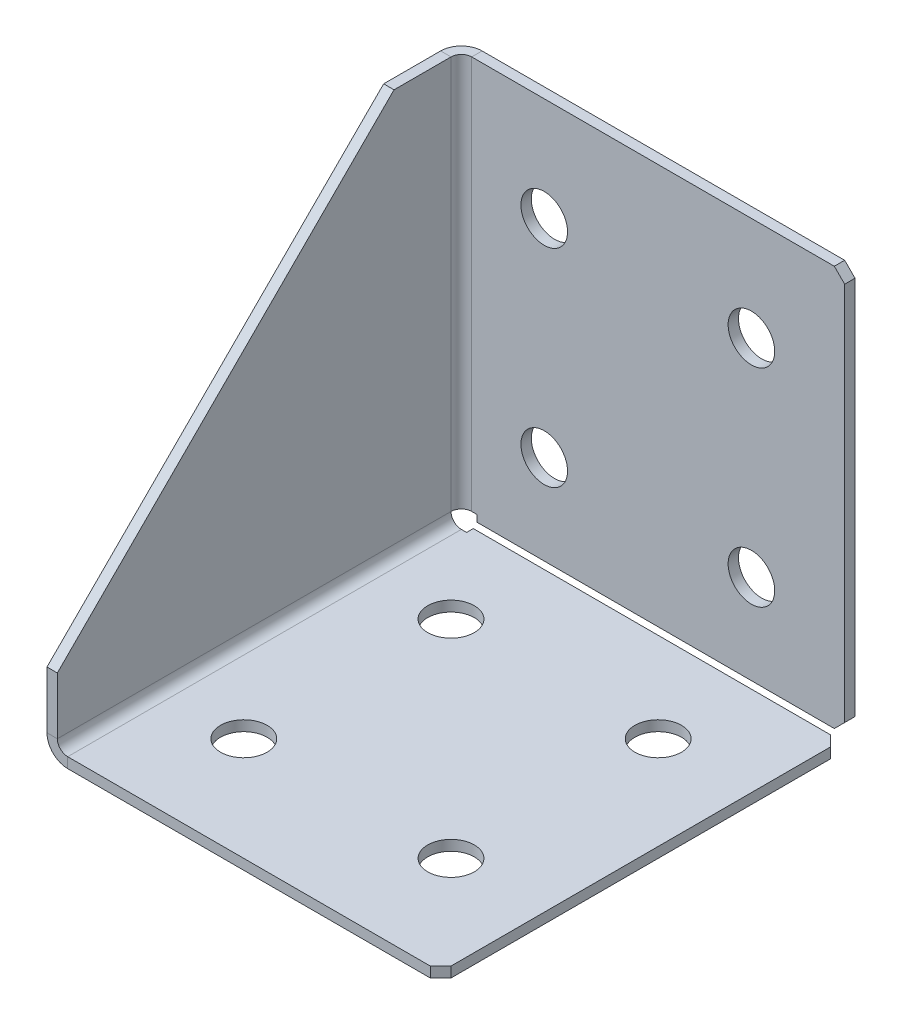
ISO-10303-21;
HEADER;
FILE_DESCRIPTION(('STEP AP214'),'2;1');
FILE_NAME('part.step','',(''),(''),'','','');
FILE_SCHEMA(('AUTOMOTIVE_DESIGN { 1 0 10303 214 1 1 1 1 }'));
ENDSEC;
DATA;
#1=APPLICATION_CONTEXT('core data for automotive mechanical design processes');
#2=APPLICATION_PROTOCOL_DEFINITION('international standard','automotive_design',2000,#1);
#3=PRODUCT_CONTEXT('',#1,'mechanical');
#4=PRODUCT('Part','Part','',(#3));
#5=PRODUCT_RELATED_PRODUCT_CATEGORY('part','',(#4));
#6=PRODUCT_DEFINITION_FORMATION('','',#4);
#7=PRODUCT_DEFINITION_CONTEXT('part definition',#1,'design');
#8=PRODUCT_DEFINITION('design','',#6,#7);
#9=PRODUCT_DEFINITION_SHAPE('','',#8);
#10=(LENGTH_UNIT() NAMED_UNIT(*) SI_UNIT(.MILLI.,.METRE.));
#11=(NAMED_UNIT(*) PLANE_ANGLE_UNIT() SI_UNIT($,.RADIAN.));
#12=(NAMED_UNIT(*) SI_UNIT($,.STERADIAN.) SOLID_ANGLE_UNIT());
#13=UNCERTAINTY_MEASURE_WITH_UNIT(LENGTH_MEASURE(1.E-05),#10,'distance_accuracy_value','');
#14=(GEOMETRIC_REPRESENTATION_CONTEXT(3) GLOBAL_UNCERTAINTY_ASSIGNED_CONTEXT((#13)) GLOBAL_UNIT_ASSIGNED_CONTEXT((#10,
#11,#12)) REPRESENTATION_CONTEXT('',''));
#15=CARTESIAN_POINT('',(0.,0.,0.));
#16=DIRECTION('',(0.,0.,1.));
#17=DIRECTION('',(1.,0.,0.));
#18=AXIS2_PLACEMENT_3D('',#15,#16,#17);
#19=CARTESIAN_POINT('',(-38.,2.,80.));
#20=DIRECTION('',(0.,-1.,0.));
#21=DIRECTION('',(0.,0.,-1.));
#22=AXIS2_PLACEMENT_3D('',#19,#20,#21);
#23=PLANE('',#22);
#24=CARTESIAN_POINT('',(-20.,2.,20.));
#25=DIRECTION('',(0.,1.,0.));
#26=DIRECTION('',(0.,0.,1.));
#27=AXIS2_PLACEMENT_3D('',#24,#25,#26);
#28=CIRCLE('',#27,4.5);
#29=CARTESIAN_POINT('',(-20.,2.,24.5));
#30=VERTEX_POINT('',#29);
#31=EDGE_CURVE('E689',#30,#30,#28,.T.);
#32=ORIENTED_EDGE('',*,*,#31,.F.);
#33=EDGE_LOOP('',(#32));
#34=FACE_BOUND('',#33,.T.);
#35=DIRECTION('',(1.,0.,0.));
#36=VECTOR('',#35,1.);
#37=CARTESIAN_POINT('',(-38.,2.,80.));
#38=LINE('',#37,#36);
#39=CARTESIAN_POINT('',(-34.,2.,80.));
#40=VERTEX_POINT('',#39);
#41=CARTESIAN_POINT('',(36.,2.,80.));
#42=VERTEX_POINT('',#41);
#43=EDGE_CURVE('E348',#40,#42,#38,.T.);
#44=ORIENTED_EDGE('',*,*,#43,.T.);
#45=DIRECTION('',(-0.70710678118655,0.,0.707106781186545));
#46=VECTOR('',#45,1.);
#47=CARTESIAN_POINT('',(38.,2.,78.));
#48=LINE('',#47,#46);
#49=CARTESIAN_POINT('',(38.,2.,78.));
#50=VERTEX_POINT('',#49);
#51=EDGE_CURVE('E429',#42,#50,#48,.F.);
#52=ORIENTED_EDGE('',*,*,#51,.T.);
#53=DIRECTION('',(0.,0.,-1.));
#54=VECTOR('',#53,1.);
#55=CARTESIAN_POINT('',(38.,2.,80.));
#56=LINE('',#55,#54);
#57=CARTESIAN_POINT('',(38.,2.,4.70710678118655));
#58=VERTEX_POINT('',#57);
#59=EDGE_CURVE('E356',#50,#58,#56,.T.);
#60=ORIENTED_EDGE('',*,*,#59,.T.);
#61=DIRECTION('',(-0.707106781186548,0.,-0.707106781186548));
#62=VECTOR('',#61,1.);
#63=CARTESIAN_POINT('',(36.,2.,2.70710678118655));
#64=LINE('',#63,#62);
#65=CARTESIAN_POINT('',(36.,2.,2.70710678118655));
#66=VERTEX_POINT('',#65);
#67=EDGE_CURVE('E426',#58,#66,#64,.T.);
#68=ORIENTED_EDGE('',*,*,#67,.T.);
#69=DIRECTION('',(1.,0.,0.));
#70=VECTOR('',#69,1.);
#71=CARTESIAN_POINT('',(-38.,2.,2.70710678118655));
#72=LINE('',#71,#70);
#73=CARTESIAN_POINT('',(-32.989599,2.,2.70710678118655));
#74=VERTEX_POINT('',#73);
#75=EDGE_CURVE('E326',#74,#66,#72,.T.);
#76=ORIENTED_EDGE('',*,*,#75,.F.);
#77=DIRECTION('',(0.,0.,-1.));
#78=VECTOR('',#77,1.);
#79=CARTESIAN_POINT('',(-32.989599,2.,80.));
#80=LINE('',#79,#78);
#81=CARTESIAN_POINT('',(-32.989599,2.,3.99999999999998));
#82=VERTEX_POINT('',#81);
#83=EDGE_CURVE('E325',#82,#74,#80,.T.);
#84=ORIENTED_EDGE('',*,*,#83,.F.);
#85=DIRECTION('',(1.,0.,0.));
#86=VECTOR('',#85,1.);
#87=CARTESIAN_POINT('',(-38.,2.,3.99999999999998));
#88=LINE('',#87,#86);
#89=CARTESIAN_POINT('',(-34.,2.,3.99999999999998));
#90=VERTEX_POINT('',#89);
#91=EDGE_CURVE('E321',#82,#90,#88,.F.);
#92=ORIENTED_EDGE('',*,*,#91,.T.);
#93=DIRECTION('',(0.,0.,-1.));
#94=VECTOR('',#93,1.);
#95=CARTESIAN_POINT('',(-34.,2.,80.));
#96=LINE('',#95,#94);
#97=EDGE_CURVE('E307',#40,#90,#96,.T.);
#98=ORIENTED_EDGE('',*,*,#97,.F.);
#99=EDGE_LOOP('',(#44,#52,#60,#68,#76,#84,#92,#98));
#100=FACE_BOUND('',#99,.T.);
#101=CARTESIAN_POINT('',(20.,2.,20.));
#102=DIRECTION('',(0.,1.,0.));
#103=DIRECTION('',(0.,0.,1.));
#104=AXIS2_PLACEMENT_3D('',#101,#102,#103);
#105=CIRCLE('',#104,4.5);
#106=CARTESIAN_POINT('',(20.,2.,24.5));
#107=VERTEX_POINT('',#106);
#108=EDGE_CURVE('E665',#107,#107,#105,.T.);
#109=ORIENTED_EDGE('',*,*,#108,.F.);
#110=EDGE_LOOP('',(#109));
#111=FACE_BOUND('',#110,.T.);
#112=CARTESIAN_POINT('',(-20.,2.,60.));
#113=DIRECTION('',(0.,1.,0.));
#114=DIRECTION('',(0.,0.,1.));
#115=AXIS2_PLACEMENT_3D('',#112,#113,#114);
#116=CIRCLE('',#115,4.5);
#117=CARTESIAN_POINT('',(-20.,2.,64.5));
#118=VERTEX_POINT('',#117);
#119=EDGE_CURVE('E673',#118,#118,#116,.T.);
#120=ORIENTED_EDGE('',*,*,#119,.F.);
#121=EDGE_LOOP('',(#120));
#122=FACE_BOUND('',#121,.T.);
#123=CARTESIAN_POINT('',(20.,2.,60.));
#124=DIRECTION('',(0.,1.,0.));
#125=DIRECTION('',(0.,0.,1.));
#126=AXIS2_PLACEMENT_3D('',#123,#124,#125);
#127=CIRCLE('',#126,4.5);
#128=CARTESIAN_POINT('',(20.,2.,64.5));
#129=VERTEX_POINT('',#128);
#130=EDGE_CURVE('E681',#129,#129,#127,.T.);
#131=ORIENTED_EDGE('',*,*,#130,.F.);
#132=EDGE_LOOP('',(#131));
#133=FACE_BOUND('',#132,.T.);
#134=ADVANCED_FACE('F50',(#34,#100,#111,#122,#133),#23,.F.);
#135=CARTESIAN_POINT('',(-38.,0.,2.));
#136=DIRECTION('',(0.,0.,-1.));
#137=DIRECTION('',(-1.,0.,0.));
#138=AXIS2_PLACEMENT_3D('',#135,#136,#137);
#139=PLANE('',#138);
#140=DIRECTION('',(-1.,0.,0.));
#141=VECTOR('',#140,1.);
#142=CARTESIAN_POINT('',(-38.,2.70710678118655,2.));
#143=LINE('',#142,#141);
#144=CARTESIAN_POINT('',(36.,2.70710678118655,2.));
#145=VERTEX_POINT('',#144);
#146=CARTESIAN_POINT('',(-32.989599,2.70710678118655,2.));
#147=VERTEX_POINT('',#146);
#148=EDGE_CURVE('E322',#145,#147,#143,.T.);
#149=ORIENTED_EDGE('',*,*,#148,.F.);
#150=DIRECTION('',(0.707106781186548,0.707106781186548,0.));
#151=VECTOR('',#150,1.);
#152=CARTESIAN_POINT('',(38.,4.70710678118656,2.));
#153=LINE('',#152,#151);
#154=CARTESIAN_POINT('',(38.,4.70710678118656,2.));
#155=VERTEX_POINT('',#154);
#156=EDGE_CURVE('E60',#145,#155,#153,.T.);
#157=ORIENTED_EDGE('',*,*,#156,.T.);
#158=DIRECTION('',(0.,1.,0.));
#159=VECTOR('',#158,1.);
#160=CARTESIAN_POINT('',(38.,0.,2.));
#161=LINE('',#160,#159);
#162=CARTESIAN_POINT('',(38.,78.,2.));
#163=VERTEX_POINT('',#162);
#164=EDGE_CURVE('E327',#155,#163,#161,.T.);
#165=ORIENTED_EDGE('',*,*,#164,.T.);
#166=DIRECTION('',(-0.707106781186548,0.707106781186548,0.));
#167=VECTOR('',#166,1.);
#168=CARTESIAN_POINT('',(36.,80.,2.));
#169=LINE('',#168,#167);
#170=CARTESIAN_POINT('',(36.,80.,2.));
#171=VERTEX_POINT('',#170);
#172=EDGE_CURVE('E67',#163,#171,#169,.T.);
#173=ORIENTED_EDGE('',*,*,#172,.T.);
#174=DIRECTION('',(-1.,0.,0.));
#175=VECTOR('',#174,1.);
#176=CARTESIAN_POINT('',(-38.,80.,2.));
#177=LINE('',#176,#175);
#178=CARTESIAN_POINT('',(-34.,80.,2.));
#179=VERTEX_POINT('',#178);
#180=EDGE_CURVE('E330',#179,#171,#177,.F.);
#181=ORIENTED_EDGE('',*,*,#180,.F.);
#182=DIRECTION('',(0.,1.,0.));
#183=VECTOR('',#182,1.);
#184=CARTESIAN_POINT('',(-34.,0.,2.));
#185=LINE('',#184,#183);
#186=CARTESIAN_POINT('',(-34.,3.99999999999997,2.));
#187=VERTEX_POINT('',#186);
#188=EDGE_CURVE('E298',#187,#179,#185,.T.);
#189=ORIENTED_EDGE('',*,*,#188,.F.);
#190=DIRECTION('',(-1.,0.,0.));
#191=VECTOR('',#190,1.);
#192=CARTESIAN_POINT('',(-38.,3.99999999999997,2.));
#193=LINE('',#192,#191);
#194=CARTESIAN_POINT('',(-32.989599,3.99999999999997,2.));
#195=VERTEX_POINT('',#194);
#196=EDGE_CURVE('E303',#187,#195,#193,.F.);
#197=ORIENTED_EDGE('',*,*,#196,.T.);
#198=DIRECTION('',(0.,1.,0.));
#199=VECTOR('',#198,1.);
#200=CARTESIAN_POINT('',(-32.989599,0.,2.));
#201=LINE('',#200,#199);
#202=EDGE_CURVE('E317',#147,#195,#201,.T.);
#203=ORIENTED_EDGE('',*,*,#202,.F.);
#204=EDGE_LOOP('',(#149,#157,#165,#173,#181,#189,#197,#203));
#205=FACE_BOUND('',#204,.T.);
#206=CARTESIAN_POINT('',(20.,20.,2.));
#207=DIRECTION('',(0.,0.,1.));
#208=DIRECTION('',(1.,0.,0.));
#209=AXIS2_PLACEMENT_3D('',#206,#207,#208);
#210=CIRCLE('',#209,4.5);
#211=CARTESIAN_POINT('',(24.5,20.,2.));
#212=VERTEX_POINT('',#211);
#213=EDGE_CURVE('E633',#212,#212,#210,.T.);
#214=ORIENTED_EDGE('',*,*,#213,.F.);
#215=EDGE_LOOP('',(#214));
#216=FACE_BOUND('',#215,.T.);
#217=CARTESIAN_POINT('',(-20.,60.,2.));
#218=DIRECTION('',(0.,0.,1.));
#219=DIRECTION('',(1.,0.,0.));
#220=AXIS2_PLACEMENT_3D('',#217,#218,#219);
#221=CIRCLE('',#220,4.5);
#222=CARTESIAN_POINT('',(-15.5,60.,2.));
#223=VERTEX_POINT('',#222);
#224=EDGE_CURVE('E641',#223,#223,#221,.T.);
#225=ORIENTED_EDGE('',*,*,#224,.F.);
#226=EDGE_LOOP('',(#225));
#227=FACE_BOUND('',#226,.T.);
#228=CARTESIAN_POINT('',(20.,60.,2.));
#229=DIRECTION('',(0.,0.,1.));
#230=DIRECTION('',(1.,0.,0.));
#231=AXIS2_PLACEMENT_3D('',#228,#229,#230);
#232=CIRCLE('',#231,4.5);
#233=CARTESIAN_POINT('',(24.5,60.,2.));
#234=VERTEX_POINT('',#233);
#235=EDGE_CURVE('E649',#234,#234,#232,.T.);
#236=ORIENTED_EDGE('',*,*,#235,.F.);
#237=EDGE_LOOP('',(#236));
#238=FACE_BOUND('',#237,.T.);
#239=CARTESIAN_POINT('',(-20.,20.,2.));
#240=DIRECTION('',(0.,0.,1.));
#241=DIRECTION('',(1.,0.,0.));
#242=AXIS2_PLACEMENT_3D('',#239,#240,#241);
#243=CIRCLE('',#242,4.5);
#244=CARTESIAN_POINT('',(-15.5,20.,2.));
#245=VERTEX_POINT('',#244);
#246=EDGE_CURVE('E657',#245,#245,#243,.T.);
#247=ORIENTED_EDGE('',*,*,#246,.F.);
#248=EDGE_LOOP('',(#247));
#249=FACE_BOUND('',#248,.T.);
#250=ADVANCED_FACE('F457',(#205,#216,#227,#238,#249),#139,.F.);
#251=CARTESIAN_POINT('',(-34.,4.,3.99999999999998));
#252=DIRECTION('',(0.,0.,-1.));
#253=DIRECTION('',(-1.,0.,0.));
#254=AXIS2_PLACEMENT_3D('',#251,#252,#253);
#255=PLANE('',#254);
#256=DIRECTION('',(-1.,0.,0.));
#257=VECTOR('',#256,1.);
#258=CARTESIAN_POINT('',(-38.,3.99999999999997,3.99999999999997));
#259=LINE('',#258,#257);
#260=CARTESIAN_POINT('',(-36.,3.99999999999997,3.99999999999999));
#261=VERTEX_POINT('',#260);
#262=CARTESIAN_POINT('',(-38.,3.99999999999997,3.99999999999997));
#263=VERTEX_POINT('',#262);
#264=EDGE_CURVE('E405',#261,#263,#259,.T.);
#265=ORIENTED_EDGE('',*,*,#264,.F.);
#266=CARTESIAN_POINT('',(-34.,4.,3.99999999999998));
#267=DIRECTION('',(0.,0.,1.));
#268=DIRECTION('',(1.,0.,0.));
#269=AXIS2_PLACEMENT_3D('',#266,#267,#268);
#270=CIRCLE('',#269,2.);
#271=EDGE_CURVE('E352',#261,#90,#270,.T.);
#272=ORIENTED_EDGE('',*,*,#271,.T.);
#273=DIRECTION('',(0.,-1.,0.));
#274=VECTOR('',#273,1.);
#275=CARTESIAN_POINT('',(-34.,0.,3.99999999999998));
#276=LINE('',#275,#274);
#277=CARTESIAN_POINT('',(-34.,0.,3.99999999999998));
#278=VERTEX_POINT('',#277);
#279=EDGE_CURVE('E402',#90,#278,#276,.T.);
#280=ORIENTED_EDGE('',*,*,#279,.T.);
#281=CARTESIAN_POINT('',(-34.,4.,3.99999999999998));
#282=DIRECTION('',(0.,0.,1.));
#283=DIRECTION('',(1.,0.,0.));
#284=AXIS2_PLACEMENT_3D('',#281,#282,#283);
#285=CIRCLE('',#284,4.);
#286=EDGE_CURVE('E290',#263,#278,#285,.T.);
#287=ORIENTED_EDGE('',*,*,#286,.F.);
#288=EDGE_LOOP('',(#265,#272,#280,#287));
#289=FACE_BOUND('',#288,.T.);
#290=ADVANCED_FACE('F488',(#289),#255,.T.);
#291=CARTESIAN_POINT('',(-38.,0.,3.99999999999998));
#292=DIRECTION('',(0.,0.,1.));
#293=DIRECTION('',(-1.,0.,0.));
#294=AXIS2_PLACEMENT_3D('',#291,#292,#293);
#295=PLANE('',#294);
#296=ORIENTED_EDGE('',*,*,#279,.F.);
#297=ORIENTED_EDGE('',*,*,#91,.F.);
#298=DIRECTION('',(0.,-1.,0.));
#299=VECTOR('',#298,1.);
#300=CARTESIAN_POINT('',(-32.989599,0.,3.99999999999998));
#301=LINE('',#300,#299);
#302=CARTESIAN_POINT('',(-32.989599,0.,3.99999999999998));
#303=VERTEX_POINT('',#302);
#304=EDGE_CURVE('E399',#82,#303,#301,.T.);
#305=ORIENTED_EDGE('',*,*,#304,.T.);
#306=DIRECTION('',(-1.,0.,0.));
#307=VECTOR('',#306,1.);
#308=CARTESIAN_POINT('',(-38.,0.,3.99999999999998));
#309=LINE('',#308,#307);
#310=EDGE_CURVE('E254',#303,#278,#309,.T.);
#311=ORIENTED_EDGE('',*,*,#310,.T.);
#312=EDGE_LOOP('',(#296,#297,#305,#311));
#313=FACE_BOUND('',#312,.T.);
#314=ADVANCED_FACE('F575',(#313),#295,.F.);
#315=CARTESIAN_POINT('',(-32.989599,0.,80.));
#316=DIRECTION('',(-1.,0.,0.));
#317=DIRECTION('',(0.,0.,-1.));
#318=AXIS2_PLACEMENT_3D('',#315,#316,#317);
#319=PLANE('',#318);
#320=ORIENTED_EDGE('',*,*,#304,.F.);
#321=ORIENTED_EDGE('',*,*,#83,.T.);
#322=DIRECTION('',(0.,-1.,0.));
#323=VECTOR('',#322,1.);
#324=CARTESIAN_POINT('',(-32.989599,0.,2.70710678118655));
#325=LINE('',#324,#323);
#326=CARTESIAN_POINT('',(-32.989599,0.,2.70710678118655));
#327=VERTEX_POINT('',#326);
#328=EDGE_CURVE('E396',#74,#327,#325,.T.);
#329=ORIENTED_EDGE('',*,*,#328,.T.);
#330=DIRECTION('',(0.,0.,-1.));
#331=VECTOR('',#330,1.);
#332=CARTESIAN_POINT('',(-32.989599,0.,80.));
#333=LINE('',#332,#331);
#334=EDGE_CURVE('E250',#303,#327,#333,.T.);
#335=ORIENTED_EDGE('',*,*,#334,.F.);
#336=EDGE_LOOP('',(#320,#321,#329,#335));
#337=FACE_BOUND('',#336,.T.);
#338=ADVANCED_FACE('F571',(#337),#319,.T.);
#339=CARTESIAN_POINT('',(-38.,0.,2.70710678118655));
#340=DIRECTION('',(0.,0.,-1.));
#341=DIRECTION('',(1.,0.,0.));
#342=AXIS2_PLACEMENT_3D('',#339,#340,#341);
#343=PLANE('',#342);
#344=ORIENTED_EDGE('',*,*,#75,.T.);
#345=DIRECTION('',(0.,-1.,0.));
#346=VECTOR('',#345,1.);
#347=CARTESIAN_POINT('',(36.,0.,2.70710678118655));
#348=LINE('',#347,#346);
#349=CARTESIAN_POINT('',(36.,0.,2.70710678118655));
#350=VERTEX_POINT('',#349);
#351=EDGE_CURVE('E432',#66,#350,#348,.T.);
#352=ORIENTED_EDGE('',*,*,#351,.T.);
#353=DIRECTION('',(1.,0.,0.));
#354=VECTOR('',#353,1.);
#355=CARTESIAN_POINT('',(-38.,0.,2.70710678118655));
#356=LINE('',#355,#354);
#357=EDGE_CURVE('E243',#327,#350,#356,.T.);
#358=ORIENTED_EDGE('',*,*,#357,.F.);
#359=ORIENTED_EDGE('',*,*,#328,.F.);
#360=EDGE_LOOP('',(#344,#352,#358,#359));
#361=FACE_BOUND('',#360,.T.);
#362=ADVANCED_FACE('F567',(#361),#343,.T.);
#363=CARTESIAN_POINT('',(38.,0.,80.));
#364=DIRECTION('',(-1.,0.,0.));
#365=DIRECTION('',(0.,0.,-1.));
#366=AXIS2_PLACEMENT_3D('',#363,#364,#365);
#367=PLANE('',#366);
#368=ORIENTED_EDGE('',*,*,#59,.F.);
#369=DIRECTION('',(0.,1.,0.));
#370=VECTOR('',#369,1.);
#371=CARTESIAN_POINT('',(38.,0.,78.));
#372=LINE('',#371,#370);
#373=CARTESIAN_POINT('',(38.,0.,78.));
#374=VERTEX_POINT('',#373);
#375=EDGE_CURVE('E413',#50,#374,#372,.F.);
#376=ORIENTED_EDGE('',*,*,#375,.T.);
#377=DIRECTION('',(0.,0.,-1.));
#378=VECTOR('',#377,1.);
#379=CARTESIAN_POINT('',(38.,0.,80.));
#380=LINE('',#379,#378);
#381=CARTESIAN_POINT('',(38.,0.,4.70710678118655));
#382=VERTEX_POINT('',#381);
#383=EDGE_CURVE('E283',#374,#382,#380,.T.);
#384=ORIENTED_EDGE('',*,*,#383,.T.);
#385=DIRECTION('',(0.,-1.,0.));
#386=VECTOR('',#385,1.);
#387=CARTESIAN_POINT('',(38.,0.,4.70710678118655));
#388=LINE('',#387,#386);
#389=EDGE_CURVE('E408',#382,#58,#388,.F.);
#390=ORIENTED_EDGE('',*,*,#389,.T.);
#391=EDGE_LOOP('',(#368,#376,#384,#390));
#392=FACE_BOUND('',#391,.T.);
#393=ADVANCED_FACE('F563',(#392),#367,.F.);
#394=CARTESIAN_POINT('',(-38.,0.,80.));
#395=DIRECTION('',(0.,0.,-1.));
#396=DIRECTION('',(1.,0.,0.));
#397=AXIS2_PLACEMENT_3D('',#394,#395,#396);
#398=PLANE('',#397);
#399=DIRECTION('',(1.,0.,0.));
#400=VECTOR('',#399,1.);
#401=CARTESIAN_POINT('',(-38.,0.,80.));
#402=LINE('',#401,#400);
#403=CARTESIAN_POINT('',(-34.,0.,80.));
#404=VERTEX_POINT('',#403);
#405=CARTESIAN_POINT('',(36.,0.,80.));
#406=VERTEX_POINT('',#405);
#407=EDGE_CURVE('E223',#404,#406,#402,.T.);
#408=ORIENTED_EDGE('',*,*,#407,.T.);
#409=DIRECTION('',(0.,-1.,0.));
#410=VECTOR('',#409,1.);
#411=CARTESIAN_POINT('',(36.,0.,80.));
#412=LINE('',#411,#410);
#413=EDGE_CURVE('E423',#406,#42,#412,.F.);
#414=ORIENTED_EDGE('',*,*,#413,.T.);
#415=ORIENTED_EDGE('',*,*,#43,.F.);
#416=DIRECTION('',(0.,-1.,0.));
#417=VECTOR('',#416,1.);
#418=CARTESIAN_POINT('',(-34.,0.,80.));
#419=LINE('',#418,#417);
#420=EDGE_CURVE('E393',#40,#404,#419,.T.);
#421=ORIENTED_EDGE('',*,*,#420,.T.);
#422=EDGE_LOOP('',(#408,#414,#415,#421));
#423=FACE_BOUND('',#422,.T.);
#424=ADVANCED_FACE('F560',(#423),#398,.F.);
#425=CARTESIAN_POINT('',(-34.,4.,80.));
#426=DIRECTION('',(0.,0.,-1.));
#427=DIRECTION('',(-1.,0.,0.));
#428=AXIS2_PLACEMENT_3D('',#425,#426,#427);
#429=PLANE('',#428);
#430=ORIENTED_EDGE('',*,*,#420,.F.);
#431=CARTESIAN_POINT('',(-34.,4.,80.));
#432=DIRECTION('',(0.,0.,1.));
#433=DIRECTION('',(1.,0.,0.));
#434=AXIS2_PLACEMENT_3D('',#431,#432,#433);
#435=CIRCLE('',#434,2.);
#436=CARTESIAN_POINT('',(-36.,4.,80.));
#437=VERTEX_POINT('',#436);
#438=EDGE_CURVE('E339',#40,#437,#435,.F.);
#439=ORIENTED_EDGE('',*,*,#438,.T.);
#440=DIRECTION('',(-1.,0.,0.));
#441=VECTOR('',#440,1.);
#442=CARTESIAN_POINT('',(-38.,4.,80.));
#443=LINE('',#442,#441);
#444=CARTESIAN_POINT('',(-38.,4.,80.));
#445=VERTEX_POINT('',#444);
#446=EDGE_CURVE('E210',#437,#445,#443,.T.);
#447=ORIENTED_EDGE('',*,*,#446,.T.);
#448=CARTESIAN_POINT('',(-34.,4.,80.));
#449=DIRECTION('',(0.,0.,1.));
#450=DIRECTION('',(1.,0.,0.));
#451=AXIS2_PLACEMENT_3D('',#448,#449,#450);
#452=CIRCLE('',#451,4.);
#453=EDGE_CURVE('E279',#404,#445,#452,.F.);
#454=ORIENTED_EDGE('',*,*,#453,.F.);
#455=EDGE_LOOP('',(#430,#439,#447,#454));
#456=FACE_BOUND('',#455,.T.);
#457=ADVANCED_FACE('F496',(#456),#429,.F.);
#458=CARTESIAN_POINT('',(-38.,15.,80.));
#459=DIRECTION('',(0.,0.,1.));
#460=DIRECTION('',(0.,-1.,0.));
#461=AXIS2_PLACEMENT_3D('',#458,#459,#460);
#462=PLANE('',#461);
#463=ORIENTED_EDGE('',*,*,#446,.F.);
#464=DIRECTION('',(0.,1.,0.));
#465=VECTOR('',#464,1.);
#466=CARTESIAN_POINT('',(-36.,0.,80.));
#467=LINE('',#466,#465);
#468=CARTESIAN_POINT('',(-36.,15.,80.));
#469=VERTEX_POINT('',#468);
#470=EDGE_CURVE('E204',#469,#437,#467,.F.);
#471=ORIENTED_EDGE('',*,*,#470,.F.);
#472=DIRECTION('',(-1.,0.,0.));
#473=VECTOR('',#472,1.);
#474=CARTESIAN_POINT('',(-38.,15.,80.));
#475=LINE('',#474,#473);
#476=CARTESIAN_POINT('',(-38.,15.,80.));
#477=VERTEX_POINT('',#476);
#478=EDGE_CURVE('E198',#469,#477,#475,.T.);
#479=ORIENTED_EDGE('',*,*,#478,.T.);
#480=DIRECTION('',(0.,-1.,0.));
#481=VECTOR('',#480,1.);
#482=CARTESIAN_POINT('',(-38.,15.,80.));
#483=LINE('',#482,#481);
#484=EDGE_CURVE('E201',#477,#445,#483,.T.);
#485=ORIENTED_EDGE('',*,*,#484,.T.);
#486=EDGE_LOOP('',(#463,#471,#479,#485));
#487=FACE_BOUND('',#486,.T.);
#488=ADVANCED_FACE('F200',(#487),#462,.T.);
#489=CARTESIAN_POINT('',(-38.,80.,15.));
#490=DIRECTION('',(0.,0.707106781186548,0.707106781186548));
#491=DIRECTION('',(0.,-0.707106781186547,0.707106781186547));
#492=AXIS2_PLACEMENT_3D('',#489,#490,#491);
#493=PLANE('',#492);
#494=ORIENTED_EDGE('',*,*,#478,.F.);
#495=DIRECTION('',(0.,-0.707106781186547,0.707106781186547));
#496=VECTOR('',#495,1.);
#497=CARTESIAN_POINT('',(-36.,80.,15.));
#498=LINE('',#497,#496);
#499=CARTESIAN_POINT('',(-36.,80.,15.));
#500=VERTEX_POINT('',#499);
#501=EDGE_CURVE('E343',#500,#469,#498,.T.);
#502=ORIENTED_EDGE('',*,*,#501,.F.);
#503=DIRECTION('',(-1.,0.,0.));
#504=VECTOR('',#503,1.);
#505=CARTESIAN_POINT('',(-38.,80.,15.));
#506=LINE('',#505,#504);
#507=CARTESIAN_POINT('',(-38.,80.,15.));
#508=VERTEX_POINT('',#507);
#509=EDGE_CURVE('E211',#500,#508,#506,.T.);
#510=ORIENTED_EDGE('',*,*,#509,.T.);
#511=DIRECTION('',(0.,-0.707106781186547,0.707106781186547));
#512=VECTOR('',#511,1.);
#513=CARTESIAN_POINT('',(-38.,80.,15.));
#514=LINE('',#513,#512);
#515=EDGE_CURVE('E218',#508,#477,#514,.T.);
#516=ORIENTED_EDGE('',*,*,#515,.T.);
#517=EDGE_LOOP('',(#494,#502,#510,#516));
#518=FACE_BOUND('',#517,.T.);
#519=ADVANCED_FACE('F225',(#518),#493,.T.);
#520=CARTESIAN_POINT('',(-38.,80.,0.));
#521=DIRECTION('',(0.,1.,0.));
#522=DIRECTION('',(0.,0.,1.));
#523=AXIS2_PLACEMENT_3D('',#520,#521,#522);
#524=PLANE('',#523);
#525=ORIENTED_EDGE('',*,*,#509,.F.);
#526=DIRECTION('',(0.,0.,-1.));
#527=VECTOR('',#526,1.);
#528=CARTESIAN_POINT('',(-36.,80.,0.));
#529=LINE('',#528,#527);
#530=CARTESIAN_POINT('',(-36.,80.,4.));
#531=VERTEX_POINT('',#530);
#532=EDGE_CURVE('E333',#531,#500,#529,.F.);
#533=ORIENTED_EDGE('',*,*,#532,.F.);
#534=DIRECTION('',(-1.,0.,0.));
#535=VECTOR('',#534,1.);
#536=CARTESIAN_POINT('',(-38.,80.,4.));
#537=LINE('',#536,#535);
#538=CARTESIAN_POINT('',(-38.,80.,4.));
#539=VERTEX_POINT('',#538);
#540=EDGE_CURVE('E386',#531,#539,#537,.T.);
#541=ORIENTED_EDGE('',*,*,#540,.T.);
#542=DIRECTION('',(0.,0.,1.));
#543=VECTOR('',#542,1.);
#544=CARTESIAN_POINT('',(-38.,80.,0.));
#545=LINE('',#544,#543);
#546=EDGE_CURVE('E227',#539,#508,#545,.T.);
#547=ORIENTED_EDGE('',*,*,#546,.T.);
#548=EDGE_LOOP('',(#525,#533,#541,#547));
#549=FACE_BOUND('',#548,.T.);
#550=ADVANCED_FACE('F509',(#549),#524,.T.);
#551=CARTESIAN_POINT('',(-34.,80.,4.));
#552=DIRECTION('',(0.,1.,0.));
#553=DIRECTION('',(0.,0.,1.));
#554=AXIS2_PLACEMENT_3D('',#551,#552,#553);
#555=PLANE('',#554);
#556=ORIENTED_EDGE('',*,*,#540,.F.);
#557=CARTESIAN_POINT('',(-34.,80.,4.));
#558=DIRECTION('',(0.,-1.,0.));
#559=DIRECTION('',(0.,0.,-1.));
#560=AXIS2_PLACEMENT_3D('',#557,#558,#559);
#561=CIRCLE('',#560,2.);
#562=EDGE_CURVE('E334',#531,#179,#561,.T.);
#563=ORIENTED_EDGE('',*,*,#562,.T.);
#564=DIRECTION('',(0.,0.,-1.));
#565=VECTOR('',#564,1.);
#566=CARTESIAN_POINT('',(-34.,80.,0.));
#567=LINE('',#566,#565);
#568=CARTESIAN_POINT('',(-34.,80.,0.));
#569=VERTEX_POINT('',#568);
#570=EDGE_CURVE('E383',#179,#569,#567,.T.);
#571=ORIENTED_EDGE('',*,*,#570,.T.);
#572=CARTESIAN_POINT('',(-34.,80.,4.));
#573=DIRECTION('',(0.,-1.,0.));
#574=DIRECTION('',(0.,0.,-1.));
#575=AXIS2_PLACEMENT_3D('',#572,#573,#574);
#576=CIRCLE('',#575,4.);
#577=EDGE_CURVE('E274',#539,#569,#576,.T.);
#578=ORIENTED_EDGE('',*,*,#577,.F.);
#579=EDGE_LOOP('',(#556,#563,#571,#578));
#580=FACE_BOUND('',#579,.T.);
#581=ADVANCED_FACE('F511',(#580),#555,.T.);
#582=CARTESIAN_POINT('',(-38.,80.,0.));
#583=DIRECTION('',(0.,1.,0.));
#584=DIRECTION('',(1.,0.,0.));
#585=AXIS2_PLACEMENT_3D('',#582,#583,#584);
#586=PLANE('',#585);
#587=ORIENTED_EDGE('',*,*,#180,.T.);
#588=DIRECTION('',(0.,0.,-1.));
#589=VECTOR('',#588,1.);
#590=CARTESIAN_POINT('',(36.,80.,0.));
#591=LINE('',#590,#589);
#592=CARTESIAN_POINT('',(36.,80.,0.));
#593=VERTEX_POINT('',#592);
#594=EDGE_CURVE('E11',#171,#593,#591,.T.);
#595=ORIENTED_EDGE('',*,*,#594,.T.);
#596=DIRECTION('',(1.,0.,0.));
#597=VECTOR('',#596,1.);
#598=CARTESIAN_POINT('',(-38.,80.,0.));
#599=LINE('',#598,#597);
#600=EDGE_CURVE('E232',#569,#593,#599,.T.);
#601=ORIENTED_EDGE('',*,*,#600,.F.);
#602=ORIENTED_EDGE('',*,*,#570,.F.);
#603=EDGE_LOOP('',(#587,#595,#601,#602));
#604=FACE_BOUND('',#603,.T.);
#605=ADVANCED_FACE('F514',(#604),#586,.T.);
#606=CARTESIAN_POINT('',(38.,0.,0.));
#607=DIRECTION('',(-1.,0.,0.));
#608=DIRECTION('',(0.,1.,0.));
#609=AXIS2_PLACEMENT_3D('',#606,#607,#608);
#610=PLANE('',#609);
#611=ORIENTED_EDGE('',*,*,#164,.F.);
#612=DIRECTION('',(0.,0.,1.));
#613=VECTOR('',#612,1.);
#614=CARTESIAN_POINT('',(38.,4.70710678118656,0.));
#615=LINE('',#614,#613);
#616=CARTESIAN_POINT('',(38.,4.70710678118656,0.));
#617=VERTEX_POINT('',#616);
#618=EDGE_CURVE('E439',#155,#617,#615,.F.);
#619=ORIENTED_EDGE('',*,*,#618,.T.);
#620=DIRECTION('',(0.,1.,0.));
#621=VECTOR('',#620,1.);
#622=CARTESIAN_POINT('',(38.,0.,0.));
#623=LINE('',#622,#621);
#624=CARTESIAN_POINT('',(38.,78.,0.));
#625=VERTEX_POINT('',#624);
#626=EDGE_CURVE('E239',#617,#625,#623,.T.);
#627=ORIENTED_EDGE('',*,*,#626,.T.);
#628=DIRECTION('',(0.,0.,-1.));
#629=VECTOR('',#628,1.);
#630=CARTESIAN_POINT('',(38.,78.,0.));
#631=LINE('',#630,#629);
#632=EDGE_CURVE('E436',#625,#163,#631,.F.);
#633=ORIENTED_EDGE('',*,*,#632,.T.);
#634=EDGE_LOOP('',(#611,#619,#627,#633));
#635=FACE_BOUND('',#634,.T.);
#636=ADVANCED_FACE('F463',(#635),#610,.F.);
#637=CARTESIAN_POINT('',(-38.,2.70710678118655,0.));
#638=DIRECTION('',(0.,-1.,0.));
#639=DIRECTION('',(-1.,0.,0.));
#640=AXIS2_PLACEMENT_3D('',#637,#638,#639);
#641=PLANE('',#640);
#642=DIRECTION('',(-1.,0.,0.));
#643=VECTOR('',#642,1.);
#644=CARTESIAN_POINT('',(-38.,2.70710678118655,0.));
#645=LINE('',#644,#643);
#646=CARTESIAN_POINT('',(36.,2.70710678118655,0.));
#647=VERTEX_POINT('',#646);
#648=CARTESIAN_POINT('',(-32.989599,2.70710678118655,0.));
#649=VERTEX_POINT('',#648);
#650=EDGE_CURVE('E247',#647,#649,#645,.T.);
#651=ORIENTED_EDGE('',*,*,#650,.F.);
#652=DIRECTION('',(0.,0.,1.));
#653=VECTOR('',#652,1.);
#654=CARTESIAN_POINT('',(36.,2.70710678118655,0.));
#655=LINE('',#654,#653);
#656=EDGE_CURVE('E75',#647,#145,#655,.T.);
#657=ORIENTED_EDGE('',*,*,#656,.T.);
#658=ORIENTED_EDGE('',*,*,#148,.T.);
#659=DIRECTION('',(0.,0.,-1.));
#660=VECTOR('',#659,1.);
#661=CARTESIAN_POINT('',(-32.989599,2.70710678118655,0.));
#662=LINE('',#661,#660);
#663=EDGE_CURVE('E379',#147,#649,#662,.T.);
#664=ORIENTED_EDGE('',*,*,#663,.T.);
#665=EDGE_LOOP('',(#651,#657,#658,#664));
#666=FACE_BOUND('',#665,.T.);
#667=ADVANCED_FACE('F469',(#666),#641,.T.);
#668=CARTESIAN_POINT('',(-32.989599,0.,0.));
#669=DIRECTION('',(-1.,0.,0.));
#670=DIRECTION('',(0.,1.,0.));
#671=AXIS2_PLACEMENT_3D('',#668,#669,#670);
#672=PLANE('',#671);
#673=ORIENTED_EDGE('',*,*,#663,.F.);
#674=ORIENTED_EDGE('',*,*,#202,.T.);
#675=DIRECTION('',(0.,0.,-1.));
#676=VECTOR('',#675,1.);
#677=CARTESIAN_POINT('',(-32.989599,3.99999999999997,0.));
#678=LINE('',#677,#676);
#679=CARTESIAN_POINT('',(-32.989599,3.99999999999997,0.));
#680=VERTEX_POINT('',#679);
#681=EDGE_CURVE('E376',#195,#680,#678,.T.);
#682=ORIENTED_EDGE('',*,*,#681,.T.);
#683=DIRECTION('',(0.,1.,0.));
#684=VECTOR('',#683,1.);
#685=CARTESIAN_POINT('',(-32.989599,0.,0.));
#686=LINE('',#685,#684);
#687=EDGE_CURVE('E258',#649,#680,#686,.T.);
#688=ORIENTED_EDGE('',*,*,#687,.F.);
#689=EDGE_LOOP('',(#673,#674,#682,#688));
#690=FACE_BOUND('',#689,.T.);
#691=ADVANCED_FACE('F473',(#690),#672,.T.);
#692=CARTESIAN_POINT('',(-38.,3.99999999999997,0.));
#693=DIRECTION('',(0.,1.,0.));
#694=DIRECTION('',(1.,0.,0.));
#695=AXIS2_PLACEMENT_3D('',#692,#693,#694);
#696=PLANE('',#695);
#697=ORIENTED_EDGE('',*,*,#681,.F.);
#698=ORIENTED_EDGE('',*,*,#196,.F.);
#699=DIRECTION('',(0.,0.,-1.));
#700=VECTOR('',#699,1.);
#701=CARTESIAN_POINT('',(-34.,3.99999999999997,0.));
#702=LINE('',#701,#700);
#703=CARTESIAN_POINT('',(-34.,3.99999999999997,0.));
#704=VERTEX_POINT('',#703);
#705=EDGE_CURVE('E289',#187,#704,#702,.T.);
#706=ORIENTED_EDGE('',*,*,#705,.T.);
#707=DIRECTION('',(1.,0.,0.));
#708=VECTOR('',#707,1.);
#709=CARTESIAN_POINT('',(-38.,3.99999999999997,0.));
#710=LINE('',#709,#708);
#711=EDGE_CURVE('E262',#704,#680,#710,.T.);
#712=ORIENTED_EDGE('',*,*,#711,.T.);
#713=EDGE_LOOP('',(#697,#698,#706,#712));
#714=FACE_BOUND('',#713,.T.);
#715=ADVANCED_FACE('F477',(#714),#696,.F.);
#716=CARTESIAN_POINT('',(-34.,3.99999999999997,4.));
#717=DIRECTION('',(0.,-1.,0.));
#718=DIRECTION('',(0.,0.,-1.));
#719=AXIS2_PLACEMENT_3D('',#716,#717,#718);
#720=PLANE('',#719);
#721=CARTESIAN_POINT('',(-34.,3.99999999999997,4.));
#722=DIRECTION('',(0.,-1.,0.));
#723=DIRECTION('',(0.,0.,-1.));
#724=AXIS2_PLACEMENT_3D('',#721,#722,#723);
#725=CIRCLE('',#724,2.);
#726=EDGE_CURVE('E338',#187,#261,#725,.F.);
#727=ORIENTED_EDGE('',*,*,#726,.T.);
#728=ORIENTED_EDGE('',*,*,#264,.T.);
#729=CARTESIAN_POINT('',(-34.,3.99999999999997,4.));
#730=DIRECTION('',(0.,1.,0.));
#731=DIRECTION('',(0.,0.,1.));
#732=AXIS2_PLACEMENT_3D('',#729,#730,#731);
#733=CIRCLE('',#732,4.);
#734=EDGE_CURVE('E278',#704,#263,#733,.T.);
#735=ORIENTED_EDGE('',*,*,#734,.F.);
#736=ORIENTED_EDGE('',*,*,#705,.F.);
#737=EDGE_LOOP('',(#727,#728,#735,#736));
#738=FACE_BOUND('',#737,.T.);
#739=ADVANCED_FACE('F482',(#738),#720,.T.);
#740=CARTESIAN_POINT('',(-38.,0.,0.));
#741=DIRECTION('',(0.,0.,-1.));
#742=DIRECTION('',(-1.,0.,0.));
#743=AXIS2_PLACEMENT_3D('',#740,#741,#742);
#744=PLANE('',#743);
#745=CARTESIAN_POINT('',(-20.,20.,0.));
#746=DIRECTION('',(0.,0.,-1.));
#747=DIRECTION('',(-1.,0.,0.));
#748=AXIS2_PLACEMENT_3D('',#745,#746,#747);
#749=CIRCLE('',#748,4.5);
#750=CARTESIAN_POINT('',(-24.5,20.,0.));
#751=VERTEX_POINT('',#750);
#752=EDGE_CURVE('E653',#751,#751,#749,.T.);
#753=ORIENTED_EDGE('',*,*,#752,.F.);
#754=EDGE_LOOP('',(#753));
#755=FACE_BOUND('',#754,.T.);
#756=CARTESIAN_POINT('',(20.,60.,0.));
#757=DIRECTION('',(0.,0.,-1.));
#758=DIRECTION('',(-1.,0.,0.));
#759=AXIS2_PLACEMENT_3D('',#756,#757,#758);
#760=CIRCLE('',#759,4.5);
#761=CARTESIAN_POINT('',(15.5,60.,0.));
#762=VERTEX_POINT('',#761);
#763=EDGE_CURVE('E645',#762,#762,#760,.T.);
#764=ORIENTED_EDGE('',*,*,#763,.F.);
#765=EDGE_LOOP('',(#764));
#766=FACE_BOUND('',#765,.T.);
#767=CARTESIAN_POINT('',(-20.,60.,0.));
#768=DIRECTION('',(0.,0.,-1.));
#769=DIRECTION('',(-1.,0.,0.));
#770=AXIS2_PLACEMENT_3D('',#767,#768,#769);
#771=CIRCLE('',#770,4.5);
#772=CARTESIAN_POINT('',(-24.5,60.,0.));
#773=VERTEX_POINT('',#772);
#774=EDGE_CURVE('E637',#773,#773,#771,.T.);
#775=ORIENTED_EDGE('',*,*,#774,.F.);
#776=EDGE_LOOP('',(#775));
#777=FACE_BOUND('',#776,.T.);
#778=CARTESIAN_POINT('',(20.,20.,0.));
#779=DIRECTION('',(0.,0.,-1.));
#780=DIRECTION('',(-1.,0.,0.));
#781=AXIS2_PLACEMENT_3D('',#778,#779,#780);
#782=CIRCLE('',#781,4.5);
#783=CARTESIAN_POINT('',(15.5,20.,0.));
#784=VERTEX_POINT('',#783);
#785=EDGE_CURVE('E372',#784,#784,#782,.T.);
#786=ORIENTED_EDGE('',*,*,#785,.F.);
#787=EDGE_LOOP('',(#786));
#788=FACE_BOUND('',#787,.T.);
#789=ORIENTED_EDGE('',*,*,#626,.F.);
#790=DIRECTION('',(-0.707106781186548,-0.707106781186548,0.));
#791=VECTOR('',#790,1.);
#792=CARTESIAN_POINT('',(-2.35355339059328,-35.6464466094067,0.));
#793=LINE('',#792,#791);
#794=EDGE_CURVE('E446',#617,#647,#793,.T.);
#795=ORIENTED_EDGE('',*,*,#794,.T.);
#796=ORIENTED_EDGE('',*,*,#650,.T.);
#797=ORIENTED_EDGE('',*,*,#687,.T.);
#798=ORIENTED_EDGE('',*,*,#711,.F.);
#799=DIRECTION('',(0.,1.,0.));
#800=VECTOR('',#799,1.);
#801=CARTESIAN_POINT('',(-34.,80.,0.));
#802=LINE('',#801,#800);
#803=EDGE_CURVE('E266',#704,#569,#802,.T.);
#804=ORIENTED_EDGE('',*,*,#803,.T.);
#805=ORIENTED_EDGE('',*,*,#600,.T.);
#806=DIRECTION('',(0.707106781186548,-0.707106781186548,0.));
#807=VECTOR('',#806,1.);
#808=CARTESIAN_POINT('',(39.,77.,0.));
#809=LINE('',#808,#807);
#810=EDGE_CURVE('E443',#593,#625,#809,.T.);
#811=ORIENTED_EDGE('',*,*,#810,.T.);
#812=EDGE_LOOP('',(#789,#795,#796,#797,#798,#804,#805,#811));
#813=FACE_BOUND('',#812,.T.);
#814=ADVANCED_FACE('F468',(#755,#766,#777,#788,#813),#744,.T.);
#815=CARTESIAN_POINT('',(-38.,0.,0.));
#816=DIRECTION('',(1.,0.,0.));
#817=DIRECTION('',(0.,0.,-1.));
#818=AXIS2_PLACEMENT_3D('',#815,#816,#817);
#819=PLANE('',#818);
#820=DIRECTION('',(0.,1.,0.));
#821=VECTOR('',#820,1.);
#822=CARTESIAN_POINT('',(-38.,3.99999999999997,4.));
#823=LINE('',#822,#821);
#824=EDGE_CURVE('E270',#539,#263,#823,.F.);
#825=ORIENTED_EDGE('',*,*,#824,.T.);
#826=DIRECTION('',(0.,0.,-1.));
#827=VECTOR('',#826,1.);
#828=CARTESIAN_POINT('',(-38.,4.,80.));
#829=LINE('',#828,#827);
#830=EDGE_CURVE('E221',#263,#445,#829,.F.);
#831=ORIENTED_EDGE('',*,*,#830,.T.);
#832=ORIENTED_EDGE('',*,*,#484,.F.);
#833=ORIENTED_EDGE('',*,*,#515,.F.);
#834=ORIENTED_EDGE('',*,*,#546,.F.);
#835=EDGE_LOOP('',(#825,#831,#832,#833,#834));
#836=FACE_BOUND('',#835,.T.);
#837=ADVANCED_FACE('F216',(#836),#819,.F.);
#838=CARTESIAN_POINT('',(-38.,0.,80.));
#839=DIRECTION('',(0.,-1.,0.));
#840=DIRECTION('',(0.,0.,-1.));
#841=AXIS2_PLACEMENT_3D('',#838,#839,#840);
#842=PLANE('',#841);
#843=CARTESIAN_POINT('',(-20.,0.,20.));
#844=DIRECTION('',(0.,-1.,0.));
#845=DIRECTION('',(0.,0.,-1.));
#846=AXIS2_PLACEMENT_3D('',#843,#844,#845);
#847=CIRCLE('',#846,4.5);
#848=CARTESIAN_POINT('',(-20.,0.,15.5));
#849=VERTEX_POINT('',#848);
#850=EDGE_CURVE('E685',#849,#849,#847,.T.);
#851=ORIENTED_EDGE('',*,*,#850,.F.);
#852=EDGE_LOOP('',(#851));
#853=FACE_BOUND('',#852,.T.);
#854=CARTESIAN_POINT('',(20.,0.,60.));
#855=DIRECTION('',(0.,-1.,0.));
#856=DIRECTION('',(0.,0.,-1.));
#857=AXIS2_PLACEMENT_3D('',#854,#855,#856);
#858=CIRCLE('',#857,4.5);
#859=CARTESIAN_POINT('',(20.,0.,55.5));
#860=VERTEX_POINT('',#859);
#861=EDGE_CURVE('E677',#860,#860,#858,.T.);
#862=ORIENTED_EDGE('',*,*,#861,.F.);
#863=EDGE_LOOP('',(#862));
#864=FACE_BOUND('',#863,.T.);
#865=CARTESIAN_POINT('',(-20.,0.,60.));
#866=DIRECTION('',(0.,-1.,0.));
#867=DIRECTION('',(0.,0.,-1.));
#868=AXIS2_PLACEMENT_3D('',#865,#866,#867);
#869=CIRCLE('',#868,4.5);
#870=CARTESIAN_POINT('',(-20.,0.,55.5));
#871=VERTEX_POINT('',#870);
#872=EDGE_CURVE('E669',#871,#871,#869,.T.);
#873=ORIENTED_EDGE('',*,*,#872,.F.);
#874=EDGE_LOOP('',(#873));
#875=FACE_BOUND('',#874,.T.);
#876=CARTESIAN_POINT('',(20.,0.,20.));
#877=DIRECTION('',(0.,-1.,0.));
#878=DIRECTION('',(0.,0.,-1.));
#879=AXIS2_PLACEMENT_3D('',#876,#877,#878);
#880=CIRCLE('',#879,4.5);
#881=CARTESIAN_POINT('',(20.,0.,15.5));
#882=VERTEX_POINT('',#881);
#883=EDGE_CURVE('E661',#882,#882,#880,.T.);
#884=ORIENTED_EDGE('',*,*,#883,.F.);
#885=EDGE_LOOP('',(#884));
#886=FACE_BOUND('',#885,.T.);
#887=ORIENTED_EDGE('',*,*,#383,.F.);
#888=DIRECTION('',(0.70710678118655,0.,-0.707106781186545));
#889=VECTOR('',#888,1.);
#890=CARTESIAN_POINT('',(-1.00000000000027,0.,117.));
#891=LINE('',#890,#889);
#892=EDGE_CURVE('E420',#374,#406,#891,.F.);
#893=ORIENTED_EDGE('',*,*,#892,.T.);
#894=ORIENTED_EDGE('',*,*,#407,.F.);
#895=DIRECTION('',(0.,0.,-1.));
#896=VECTOR('',#895,1.);
#897=CARTESIAN_POINT('',(-34.,0.,3.99999999999998));
#898=LINE('',#897,#896);
#899=EDGE_CURVE('E273',#404,#278,#898,.T.);
#900=ORIENTED_EDGE('',*,*,#899,.T.);
#901=ORIENTED_EDGE('',*,*,#310,.F.);
#902=ORIENTED_EDGE('',*,*,#334,.T.);
#903=ORIENTED_EDGE('',*,*,#357,.T.);
#904=DIRECTION('',(0.707106781186548,0.,0.707106781186548));
#905=VECTOR('',#904,1.);
#906=CARTESIAN_POINT('',(37.6464466094067,0.,4.35355339059328));
#907=LINE('',#906,#905);
#908=EDGE_CURVE('E417',#350,#382,#907,.T.);
#909=ORIENTED_EDGE('',*,*,#908,.T.);
#910=EDGE_LOOP('',(#887,#893,#894,#900,#901,#902,#903,#909));
#911=FACE_BOUND('',#910,.T.);
#912=ADVANCED_FACE('F616',(#853,#864,#875,#886,#911),#842,.T.);
#913=CARTESIAN_POINT('',(-34.,0.,4.));
#914=DIRECTION('',(0.,-1.,0.));
#915=DIRECTION('',(0.,0.,-1.));
#916=AXIS2_PLACEMENT_3D('',#913,#914,#915);
#917=CYLINDRICAL_SURFACE('',#916,4.);
#918=ORIENTED_EDGE('',*,*,#734,.T.);
#919=ORIENTED_EDGE('',*,*,#824,.F.);
#920=ORIENTED_EDGE('',*,*,#577,.T.);
#921=ORIENTED_EDGE('',*,*,#803,.F.);
#922=EDGE_LOOP('',(#918,#919,#920,#921));
#923=FACE_BOUND('',#922,.T.);
#924=ADVANCED_FACE('F486',(#923),#917,.T.);
#925=CARTESIAN_POINT('',(-34.,4.,80.));
#926=DIRECTION('',(0.,0.,1.));
#927=DIRECTION('',(1.,0.,0.));
#928=AXIS2_PLACEMENT_3D('',#925,#926,#927);
#929=CYLINDRICAL_SURFACE('',#928,4.);
#930=ORIENTED_EDGE('',*,*,#453,.T.);
#931=ORIENTED_EDGE('',*,*,#830,.F.);
#932=ORIENTED_EDGE('',*,*,#286,.T.);
#933=ORIENTED_EDGE('',*,*,#899,.F.);
#934=EDGE_LOOP('',(#930,#931,#932,#933));
#935=FACE_BOUND('',#934,.T.);
#936=ADVANCED_FACE('F493',(#935),#929,.T.);
#937=CARTESIAN_POINT('',(-36.,0.,0.));
#938=DIRECTION('',(1.,0.,0.));
#939=DIRECTION('',(0.,0.,-1.));
#940=AXIS2_PLACEMENT_3D('',#937,#938,#939);
#941=PLANE('',#940);
#942=DIRECTION('',(0.,1.,0.));
#943=VECTOR('',#942,1.);
#944=CARTESIAN_POINT('',(-36.,0.,4.));
#945=LINE('',#944,#943);
#946=EDGE_CURVE('E302',#531,#261,#945,.F.);
#947=ORIENTED_EDGE('',*,*,#946,.F.);
#948=ORIENTED_EDGE('',*,*,#532,.T.);
#949=ORIENTED_EDGE('',*,*,#501,.T.);
#950=ORIENTED_EDGE('',*,*,#470,.T.);
#951=DIRECTION('',(0.,0.,-1.));
#952=VECTOR('',#951,1.);
#953=CARTESIAN_POINT('',(-36.,3.99999999999997,0.));
#954=LINE('',#953,#952);
#955=EDGE_CURVE('E294',#261,#437,#954,.F.);
#956=ORIENTED_EDGE('',*,*,#955,.F.);
#957=EDGE_LOOP('',(#947,#948,#949,#950,#956));
#958=FACE_BOUND('',#957,.T.);
#959=ADVANCED_FACE('F505',(#958),#941,.T.);
#960=CARTESIAN_POINT('',(-34.,0.,4.));
#961=DIRECTION('',(0.,-1.,0.));
#962=DIRECTION('',(0.,0.,-1.));
#963=AXIS2_PLACEMENT_3D('',#960,#961,#962);
#964=CYLINDRICAL_SURFACE('',#963,2.);
#965=ORIENTED_EDGE('',*,*,#726,.F.);
#966=ORIENTED_EDGE('',*,*,#188,.T.);
#967=ORIENTED_EDGE('',*,*,#562,.F.);
#968=ORIENTED_EDGE('',*,*,#946,.T.);
#969=EDGE_LOOP('',(#965,#966,#967,#968));
#970=FACE_BOUND('',#969,.T.);
#971=ADVANCED_FACE('F533',(#970),#964,.F.);
#972=CARTESIAN_POINT('',(-34.,4.,80.));
#973=DIRECTION('',(0.,0.,1.));
#974=DIRECTION('',(1.,0.,0.));
#975=AXIS2_PLACEMENT_3D('',#972,#973,#974);
#976=CYLINDRICAL_SURFACE('',#975,2.);
#977=ORIENTED_EDGE('',*,*,#438,.F.);
#978=ORIENTED_EDGE('',*,*,#97,.T.);
#979=ORIENTED_EDGE('',*,*,#271,.F.);
#980=ORIENTED_EDGE('',*,*,#955,.T.);
#981=EDGE_LOOP('',(#977,#978,#979,#980));
#982=FACE_BOUND('',#981,.T.);
#983=ADVANCED_FACE('F501',(#982),#976,.F.);
#984=CARTESIAN_POINT('',(20.,20.,2.));
#985=DIRECTION('',(0.,0.,1.));
#986=DIRECTION('',(1.,0.,0.));
#987=AXIS2_PLACEMENT_3D('',#984,#985,#986);
#988=CYLINDRICAL_SURFACE('',#987,4.5);
#989=ORIENTED_EDGE('',*,*,#213,.T.);
#990=EDGE_LOOP('',(#989));
#991=FACE_BOUND('',#990,.T.);
#992=ORIENTED_EDGE('',*,*,#785,.T.);
#993=EDGE_LOOP('',(#992));
#994=FACE_BOUND('',#993,.T.);
#995=ADVANCED_FACE('F539',(#991,#994),#988,.F.);
#996=CARTESIAN_POINT('',(-20.,60.,2.));
#997=DIRECTION('',(0.,0.,1.));
#998=DIRECTION('',(1.,0.,0.));
#999=AXIS2_PLACEMENT_3D('',#996,#997,#998);
#1000=CYLINDRICAL_SURFACE('',#999,4.5);
#1001=ORIENTED_EDGE('',*,*,#224,.T.);
#1002=EDGE_LOOP('',(#1001));
#1003=FACE_BOUND('',#1002,.T.);
#1004=ORIENTED_EDGE('',*,*,#774,.T.);
#1005=EDGE_LOOP('',(#1004));
#1006=FACE_BOUND('',#1005,.T.);
#1007=ADVANCED_FACE('F729',(#1003,#1006),#1000,.F.);
#1008=CARTESIAN_POINT('',(20.,60.,2.));
#1009=DIRECTION('',(0.,0.,1.));
#1010=DIRECTION('',(1.,0.,0.));
#1011=AXIS2_PLACEMENT_3D('',#1008,#1009,#1010);
#1012=CYLINDRICAL_SURFACE('',#1011,4.5);
#1013=ORIENTED_EDGE('',*,*,#235,.T.);
#1014=EDGE_LOOP('',(#1013));
#1015=FACE_BOUND('',#1014,.T.);
#1016=ORIENTED_EDGE('',*,*,#763,.T.);
#1017=EDGE_LOOP('',(#1016));
#1018=FACE_BOUND('',#1017,.T.);
#1019=ADVANCED_FACE('F722',(#1015,#1018),#1012,.F.);
#1020=CARTESIAN_POINT('',(-20.,20.,2.));
#1021=DIRECTION('',(0.,0.,1.));
#1022=DIRECTION('',(1.,0.,0.));
#1023=AXIS2_PLACEMENT_3D('',#1020,#1021,#1022);
#1024=CYLINDRICAL_SURFACE('',#1023,4.5);
#1025=ORIENTED_EDGE('',*,*,#246,.T.);
#1026=EDGE_LOOP('',(#1025));
#1027=FACE_BOUND('',#1026,.T.);
#1028=ORIENTED_EDGE('',*,*,#752,.T.);
#1029=EDGE_LOOP('',(#1028));
#1030=FACE_BOUND('',#1029,.T.);
#1031=ADVANCED_FACE('F713',(#1027,#1030),#1024,.F.);
#1032=CARTESIAN_POINT('',(20.,2.,20.));
#1033=DIRECTION('',(0.,1.,0.));
#1034=DIRECTION('',(0.,0.,1.));
#1035=AXIS2_PLACEMENT_3D('',#1032,#1033,#1034);
#1036=CYLINDRICAL_SURFACE('',#1035,4.5);
#1037=ORIENTED_EDGE('',*,*,#108,.T.);
#1038=EDGE_LOOP('',(#1037));
#1039=FACE_BOUND('',#1038,.T.);
#1040=ORIENTED_EDGE('',*,*,#883,.T.);
#1041=EDGE_LOOP('',(#1040));
#1042=FACE_BOUND('',#1041,.T.);
#1043=ADVANCED_FACE('F710',(#1039,#1042),#1036,.F.);
#1044=CARTESIAN_POINT('',(-20.,2.,60.));
#1045=DIRECTION('',(0.,1.,0.));
#1046=DIRECTION('',(0.,0.,1.));
#1047=AXIS2_PLACEMENT_3D('',#1044,#1045,#1046);
#1048=CYLINDRICAL_SURFACE('',#1047,4.5);
#1049=ORIENTED_EDGE('',*,*,#119,.T.);
#1050=EDGE_LOOP('',(#1049));
#1051=FACE_BOUND('',#1050,.T.);
#1052=ORIENTED_EDGE('',*,*,#872,.T.);
#1053=EDGE_LOOP('',(#1052));
#1054=FACE_BOUND('',#1053,.T.);
#1055=ADVANCED_FACE('F712',(#1051,#1054),#1048,.F.);
#1056=CARTESIAN_POINT('',(20.,2.,60.));
#1057=DIRECTION('',(0.,1.,0.));
#1058=DIRECTION('',(0.,0.,1.));
#1059=AXIS2_PLACEMENT_3D('',#1056,#1057,#1058);
#1060=CYLINDRICAL_SURFACE('',#1059,4.5);
#1061=ORIENTED_EDGE('',*,*,#130,.T.);
#1062=EDGE_LOOP('',(#1061));
#1063=FACE_BOUND('',#1062,.T.);
#1064=ORIENTED_EDGE('',*,*,#861,.T.);
#1065=EDGE_LOOP('',(#1064));
#1066=FACE_BOUND('',#1065,.T.);
#1067=ADVANCED_FACE('F697',(#1063,#1066),#1060,.F.);
#1068=CARTESIAN_POINT('',(-20.,2.,20.));
#1069=DIRECTION('',(0.,1.,0.));
#1070=DIRECTION('',(0.,0.,1.));
#1071=AXIS2_PLACEMENT_3D('',#1068,#1069,#1070);
#1072=CYLINDRICAL_SURFACE('',#1071,4.5);
#1073=ORIENTED_EDGE('',*,*,#31,.T.);
#1074=EDGE_LOOP('',(#1073));
#1075=FACE_BOUND('',#1074,.T.);
#1076=ORIENTED_EDGE('',*,*,#850,.T.);
#1077=EDGE_LOOP('',(#1076));
#1078=FACE_BOUND('',#1077,.T.);
#1079=ADVANCED_FACE('F591',(#1075,#1078),#1072,.F.);
#1080=CARTESIAN_POINT('',(38.,0.,78.));
#1081=DIRECTION('',(-0.707106781186545,0.,-0.70710678118655));
#1082=DIRECTION('',(0.,-1.,0.));
#1083=AXIS2_PLACEMENT_3D('',#1080,#1081,#1082);
#1084=PLANE('',#1083);
#1085=ORIENTED_EDGE('',*,*,#51,.F.);
#1086=ORIENTED_EDGE('',*,*,#413,.F.);
#1087=ORIENTED_EDGE('',*,*,#892,.F.);
#1088=ORIENTED_EDGE('',*,*,#375,.F.);
#1089=EDGE_LOOP('',(#1085,#1086,#1087,#1088));
#1090=FACE_BOUND('',#1089,.T.);
#1091=ADVANCED_FACE('F585',(#1090),#1084,.F.);
#1092=CARTESIAN_POINT('',(36.,0.,2.70710678118655));
#1093=DIRECTION('',(0.707106781186547,0.,-0.707106781186547));
#1094=DIRECTION('',(0.,1.,0.));
#1095=AXIS2_PLACEMENT_3D('',#1092,#1093,#1094);
#1096=PLANE('',#1095);
#1097=ORIENTED_EDGE('',*,*,#67,.F.);
#1098=ORIENTED_EDGE('',*,*,#389,.F.);
#1099=ORIENTED_EDGE('',*,*,#908,.F.);
#1100=ORIENTED_EDGE('',*,*,#351,.F.);
#1101=EDGE_LOOP('',(#1097,#1098,#1099,#1100));
#1102=FACE_BOUND('',#1101,.T.);
#1103=ADVANCED_FACE('F521',(#1102),#1096,.T.);
#1104=CARTESIAN_POINT('',(38.,4.70710678118656,0.));
#1105=DIRECTION('',(0.707106781186547,-0.707106781186547,0.));
#1106=DIRECTION('',(0.,0.,1.));
#1107=AXIS2_PLACEMENT_3D('',#1104,#1105,#1106);
#1108=PLANE('',#1107);
#1109=ORIENTED_EDGE('',*,*,#156,.F.);
#1110=ORIENTED_EDGE('',*,*,#656,.F.);
#1111=ORIENTED_EDGE('',*,*,#794,.F.);
#1112=ORIENTED_EDGE('',*,*,#618,.F.);
#1113=EDGE_LOOP('',(#1109,#1110,#1111,#1112));
#1114=FACE_BOUND('',#1113,.T.);
#1115=ADVANCED_FACE('F466',(#1114),#1108,.T.);
#1116=CARTESIAN_POINT('',(36.,80.,0.));
#1117=DIRECTION('',(0.707106781186547,0.707106781186547,0.));
#1118=DIRECTION('',(0.,0.,1.));
#1119=AXIS2_PLACEMENT_3D('',#1116,#1117,#1118);
#1120=PLANE('',#1119);
#1121=ORIENTED_EDGE('',*,*,#172,.F.);
#1122=ORIENTED_EDGE('',*,*,#632,.F.);
#1123=ORIENTED_EDGE('',*,*,#810,.F.);
#1124=ORIENTED_EDGE('',*,*,#594,.F.);
#1125=EDGE_LOOP('',(#1121,#1122,#1123,#1124));
#1126=FACE_BOUND('',#1125,.T.);
#1127=ADVANCED_FACE('F53',(#1126),#1120,.T.);
#1128=CLOSED_SHELL('',(#134,#250,#290,#314,#338,#362,#393,#424,#457,#488,#519,#550,#581,#605,
#636,#667,#691,#715,#739,#814,#837,#912,#924,#936,#959,#971,#983,#995,#1007,#1019,#1031,#1043,
#1055,#1067,#1079,#1091,#1103,#1115,#1127));
#1129=MANIFOLD_SOLID_BREP('B2',#1128);
#1130=ADVANCED_BREP_SHAPE_REPRESENTATION('',(#18,#1129),#14);
#1131=SHAPE_DEFINITION_REPRESENTATION(#9,#1130);
ENDSEC;
END-ISO-10303-21;
